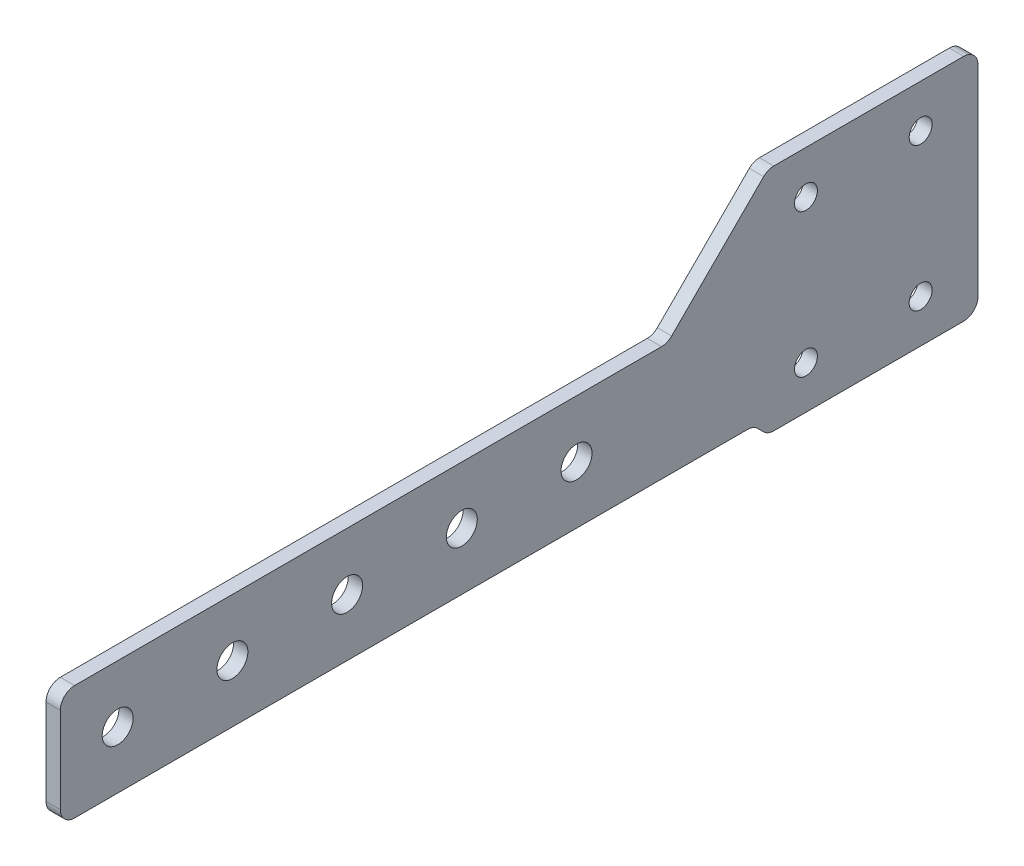
ISO-10303-21;
HEADER;
FILE_DESCRIPTION(('STEP AP214'),'2;1');
FILE_NAME('part.step','',(''),(''),'','','');
FILE_SCHEMA(('AUTOMOTIVE_DESIGN { 1 0 10303 214 1 1 1 1 }'));
ENDSEC;
DATA;
#1=APPLICATION_CONTEXT('core data for automotive mechanical design processes');
#2=APPLICATION_PROTOCOL_DEFINITION('international standard','automotive_design',2000,#1);
#3=PRODUCT_CONTEXT('',#1,'mechanical');
#4=PRODUCT('Part','Part','',(#3));
#5=PRODUCT_RELATED_PRODUCT_CATEGORY('part','',(#4));
#6=PRODUCT_DEFINITION_FORMATION('','',#4);
#7=PRODUCT_DEFINITION_CONTEXT('part definition',#1,'design');
#8=PRODUCT_DEFINITION('design','',#6,#7);
#9=PRODUCT_DEFINITION_SHAPE('','',#8);
#10=(LENGTH_UNIT() NAMED_UNIT(*) SI_UNIT(.MILLI.,.METRE.));
#11=(NAMED_UNIT(*) PLANE_ANGLE_UNIT() SI_UNIT($,.RADIAN.));
#12=(NAMED_UNIT(*) SI_UNIT($,.STERADIAN.) SOLID_ANGLE_UNIT());
#13=UNCERTAINTY_MEASURE_WITH_UNIT(LENGTH_MEASURE(1.E-05),#10,'distance_accuracy_value','');
#14=(GEOMETRIC_REPRESENTATION_CONTEXT(3) GLOBAL_UNCERTAINTY_ASSIGNED_CONTEXT((#13)) GLOBAL_UNIT_ASSIGNED_CONTEXT((#10,
#11,#12)) REPRESENTATION_CONTEXT('',''));
#15=CARTESIAN_POINT('',(0.,0.,0.));
#16=DIRECTION('',(0.,0.,1.));
#17=DIRECTION('',(1.,0.,0.));
#18=AXIS2_PLACEMENT_3D('',#15,#16,#17);
#19=CARTESIAN_POINT('',(3.175,-12.7,-85.725));
#20=DIRECTION('',(-1.,0.,0.));
#21=DIRECTION('',(0.,0.,1.));
#22=AXIS2_PLACEMENT_3D('',#19,#20,#21);
#23=PLANE('',#22);
#24=CARTESIAN_POINT('',(3.175,-12.7,-85.725));
#25=DIRECTION('',(1.,0.,0.));
#26=DIRECTION('',(0.,0.,1.));
#27=AXIS2_PLACEMENT_3D('',#24,#25,#26);
#28=CIRCLE('',#27,3.17500000000001);
#29=CARTESIAN_POINT('',(3.175,-15.875,-85.725));
#30=VERTEX_POINT('',#29);
#31=CARTESIAN_POINT('',(3.175,-12.7,-88.9));
#32=VERTEX_POINT('',#31);
#33=EDGE_CURVE('E240',#30,#32,#28,.T.);
#34=ORIENTED_EDGE('',*,*,#33,.T.);
#35=DIRECTION('',(0.,1.,0.));
#36=VECTOR('',#35,1.);
#37=CARTESIAN_POINT('',(3.175,31.75,-88.9));
#38=LINE('',#37,#36);
#39=CARTESIAN_POINT('',(3.175,31.75,-88.9));
#40=VERTEX_POINT('',#39);
#41=EDGE_CURVE('E128',#32,#40,#38,.T.);
#42=ORIENTED_EDGE('',*,*,#41,.T.);
#43=CARTESIAN_POINT('',(3.175,31.75,-85.725));
#44=DIRECTION('',(1.,0.,0.));
#45=DIRECTION('',(0.,0.,1.));
#46=AXIS2_PLACEMENT_3D('',#43,#44,#45);
#47=CIRCLE('',#46,3.175);
#48=CARTESIAN_POINT('',(3.175,34.925,-85.725));
#49=VERTEX_POINT('',#48);
#50=EDGE_CURVE('E293',#40,#49,#47,.T.);
#51=ORIENTED_EDGE('',*,*,#50,.T.);
#52=DIRECTION('',(0.,0.,1.));
#53=VECTOR('',#52,1.);
#54=CARTESIAN_POINT('',(3.175,34.925,-43.6796158183963));
#55=LINE('',#54,#53);
#56=CARTESIAN_POINT('',(3.175,34.925,-43.6796158183963));
#57=VERTEX_POINT('',#56);
#58=EDGE_CURVE('E313',#49,#57,#55,.T.);
#59=ORIENTED_EDGE('',*,*,#58,.T.);
#60=CARTESIAN_POINT('',(3.175,31.75,-43.6796158183963));
#61=DIRECTION('',(1.,0.,0.));
#62=DIRECTION('',(0.,0.,1.));
#63=AXIS2_PLACEMENT_3D('',#60,#61,#62);
#64=CIRCLE('',#63,3.17499999999999);
#65=CARTESIAN_POINT('',(3.175,33.9950640302673,-41.434551788129));
#66=VERTEX_POINT('',#65);
#67=EDGE_CURVE('E309',#57,#66,#64,.T.);
#68=ORIENTED_EDGE('',*,*,#67,.T.);
#69=DIRECTION('',(0.,-0.707106781186546,0.707106781186549));
#70=VECTOR('',#69,1.);
#71=CARTESIAN_POINT('',(3.175,13.6299359697327,-21.0694237275943));
#72=LINE('',#71,#70);
#73=CARTESIAN_POINT('',(3.175,13.6299359697327,-21.0694237275943));
#74=VERTEX_POINT('',#73);
#75=EDGE_CURVE('E312',#66,#74,#72,.T.);
#76=ORIENTED_EDGE('',*,*,#75,.T.);
#77=CARTESIAN_POINT('',(3.175,15.875,-18.8243596973271));
#78=DIRECTION('',(-1.,0.,0.));
#79=DIRECTION('',(0.,0.,-1.));
#80=AXIS2_PLACEMENT_3D('',#77,#78,#79);
#81=CIRCLE('',#80,3.175);
#82=CARTESIAN_POINT('',(3.175,12.7,-18.8243596973271));
#83=VERTEX_POINT('',#82);
#84=EDGE_CURVE('E317',#74,#83,#81,.T.);
#85=ORIENTED_EDGE('',*,*,#84,.T.);
#86=DIRECTION('',(0.,0.,1.));
#87=VECTOR('',#86,1.);
#88=CARTESIAN_POINT('',(3.175,12.7,111.125));
#89=LINE('',#88,#87);
#90=CARTESIAN_POINT('',(3.175,12.7,111.125));
#91=VERTEX_POINT('',#90);
#92=EDGE_CURVE('E324',#83,#91,#89,.T.);
#93=ORIENTED_EDGE('',*,*,#92,.T.);
#94=CARTESIAN_POINT('',(3.175,9.525,111.125));
#95=DIRECTION('',(1.,0.,0.));
#96=DIRECTION('',(0.,0.,-1.));
#97=AXIS2_PLACEMENT_3D('',#94,#95,#96);
#98=CIRCLE('',#97,3.175);
#99=CARTESIAN_POINT('',(3.175,9.52499999999998,114.3));
#100=VERTEX_POINT('',#99);
#101=EDGE_CURVE('E327',#91,#100,#98,.T.);
#102=ORIENTED_EDGE('',*,*,#101,.T.);
#103=DIRECTION('',(0.,-1.,0.));
#104=VECTOR('',#103,1.);
#105=CARTESIAN_POINT('',(3.175,-9.52499999999999,114.3));
#106=LINE('',#105,#104);
#107=CARTESIAN_POINT('',(3.175,-9.52499999999999,114.3));
#108=VERTEX_POINT('',#107);
#109=EDGE_CURVE('E330',#100,#108,#106,.T.);
#110=ORIENTED_EDGE('',*,*,#109,.T.);
#111=CARTESIAN_POINT('',(3.175,-9.52500000000001,111.125));
#112=DIRECTION('',(1.,0.,0.));
#113=DIRECTION('',(0.,0.,1.));
#114=AXIS2_PLACEMENT_3D('',#111,#112,#113);
#115=CIRCLE('',#114,3.175);
#116=CARTESIAN_POINT('',(3.175,-12.7,111.125));
#117=VERTEX_POINT('',#116);
#118=EDGE_CURVE('E333',#108,#117,#115,.T.);
#119=ORIENTED_EDGE('',*,*,#118,.T.);
#120=DIRECTION('',(0.,0.,-1.));
#121=VECTOR('',#120,1.);
#122=CARTESIAN_POINT('',(3.175,-12.7,-37.8743596973271));
#123=LINE('',#122,#121);
#124=CARTESIAN_POINT('',(3.175,-12.7,-37.8743596973271));
#125=VERTEX_POINT('',#124);
#126=EDGE_CURVE('E336',#117,#125,#123,.T.);
#127=ORIENTED_EDGE('',*,*,#126,.T.);
#128=CARTESIAN_POINT('',(3.175,-15.875,-37.8743596973271));
#129=DIRECTION('',(-1.,0.,0.));
#130=DIRECTION('',(0.,0.,-1.));
#131=AXIS2_PLACEMENT_3D('',#128,#129,#130);
#132=CIRCLE('',#131,3.175);
#133=CARTESIAN_POINT('',(3.175,-13.6299359697327,-40.1194237275944));
#134=VERTEX_POINT('',#133);
#135=EDGE_CURVE('E171',#125,#134,#132,.T.);
#136=ORIENTED_EDGE('',*,*,#135,.T.);
#137=DIRECTION('',(0.,-0.70710678118655,-0.707106781186545));
#138=VECTOR('',#137,1.);
#139=CARTESIAN_POINT('',(3.175,-14.9450640302673,-41.434551788129));
#140=LINE('',#139,#138);
#141=CARTESIAN_POINT('',(3.175,-14.9450640302673,-41.434551788129));
#142=VERTEX_POINT('',#141);
#143=EDGE_CURVE('E165',#134,#142,#140,.T.);
#144=ORIENTED_EDGE('',*,*,#143,.T.);
#145=CARTESIAN_POINT('',(3.175,-12.7,-43.6796158183963));
#146=DIRECTION('',(1.,0.,0.));
#147=DIRECTION('',(0.,0.,1.));
#148=AXIS2_PLACEMENT_3D('',#145,#146,#147);
#149=CIRCLE('',#148,3.175);
#150=CARTESIAN_POINT('',(3.175,-15.875,-43.6796158183963));
#151=VERTEX_POINT('',#150);
#152=EDGE_CURVE('E169',#142,#151,#149,.T.);
#153=ORIENTED_EDGE('',*,*,#152,.T.);
#154=DIRECTION('',(0.,0.,-1.));
#155=VECTOR('',#154,1.);
#156=CARTESIAN_POINT('',(3.175,-15.875,-85.725));
#157=LINE('',#156,#155);
#158=EDGE_CURVE('E61',#151,#30,#157,.T.);
#159=ORIENTED_EDGE('',*,*,#158,.T.);
#160=EDGE_LOOP('',(#34,#42,#51,#59,#68,#76,#85,#93,#102,#110,#119,#127,#136,#144,#153,#159));
#161=FACE_BOUND('',#160,.T.);
#162=CARTESIAN_POINT('',(3.175,0.,101.6));
#163=DIRECTION('',(1.,0.,0.));
#164=DIRECTION('',(0.,0.,-1.));
#165=AXIS2_PLACEMENT_3D('',#162,#163,#164);
#166=CIRCLE('',#165,3.429);
#167=CARTESIAN_POINT('',(3.175,0.,98.171));
#168=VERTEX_POINT('',#167);
#169=EDGE_CURVE('E198',#168,#168,#166,.T.);
#170=ORIENTED_EDGE('',*,*,#169,.F.);
#171=EDGE_LOOP('',(#170));
#172=FACE_BOUND('',#171,.T.);
#173=CARTESIAN_POINT('',(3.175,0.,76.2));
#174=DIRECTION('',(1.,0.,0.));
#175=DIRECTION('',(0.,0.,-1.));
#176=AXIS2_PLACEMENT_3D('',#173,#174,#175);
#177=CIRCLE('',#176,3.429);
#178=CARTESIAN_POINT('',(3.175,0.,72.771));
#179=VERTEX_POINT('',#178);
#180=EDGE_CURVE('E466',#179,#179,#177,.T.);
#181=ORIENTED_EDGE('',*,*,#180,.F.);
#182=EDGE_LOOP('',(#181));
#183=FACE_BOUND('',#182,.T.);
#184=CARTESIAN_POINT('',(3.175,0.,50.8));
#185=DIRECTION('',(1.,0.,0.));
#186=DIRECTION('',(0.,0.,-1.));
#187=AXIS2_PLACEMENT_3D('',#184,#185,#186);
#188=CIRCLE('',#187,3.429);
#189=CARTESIAN_POINT('',(3.175,0.,47.371));
#190=VERTEX_POINT('',#189);
#191=EDGE_CURVE('E458',#190,#190,#188,.T.);
#192=ORIENTED_EDGE('',*,*,#191,.F.);
#193=EDGE_LOOP('',(#192));
#194=FACE_BOUND('',#193,.T.);
#195=CARTESIAN_POINT('',(3.175,0.,25.4));
#196=DIRECTION('',(1.,0.,0.));
#197=DIRECTION('',(0.,0.,-1.));
#198=AXIS2_PLACEMENT_3D('',#195,#196,#197);
#199=CIRCLE('',#198,3.429);
#200=CARTESIAN_POINT('',(3.175,0.,21.971));
#201=VERTEX_POINT('',#200);
#202=EDGE_CURVE('E450',#201,#201,#199,.T.);
#203=ORIENTED_EDGE('',*,*,#202,.F.);
#204=EDGE_LOOP('',(#203));
#205=FACE_BOUND('',#204,.T.);
#206=CARTESIAN_POINT('',(3.175,0.,0.));
#207=DIRECTION('',(1.,0.,0.));
#208=DIRECTION('',(0.,0.,-1.));
#209=AXIS2_PLACEMENT_3D('',#206,#207,#208);
#210=CIRCLE('',#209,3.429);
#211=CARTESIAN_POINT('',(3.175,0.,-3.429));
#212=VERTEX_POINT('',#211);
#213=EDGE_CURVE('E442',#212,#212,#210,.T.);
#214=ORIENTED_EDGE('',*,*,#213,.F.);
#215=EDGE_LOOP('',(#214));
#216=FACE_BOUND('',#215,.T.);
#217=CARTESIAN_POINT('',(3.175,25.4,-50.8));
#218=DIRECTION('',(1.,0.,0.));
#219=DIRECTION('',(0.,0.,-1.));
#220=AXIS2_PLACEMENT_3D('',#217,#218,#219);
#221=CIRCLE('',#220,2.54);
#222=CARTESIAN_POINT('',(3.175,25.4,-53.34));
#223=VERTEX_POINT('',#222);
#224=EDGE_CURVE('E434',#223,#223,#221,.T.);
#225=ORIENTED_EDGE('',*,*,#224,.F.);
#226=EDGE_LOOP('',(#225));
#227=FACE_BOUND('',#226,.T.);
#228=CARTESIAN_POINT('',(3.175,25.4,-76.2));
#229=DIRECTION('',(1.,0.,0.));
#230=DIRECTION('',(0.,0.,-1.));
#231=AXIS2_PLACEMENT_3D('',#228,#229,#230);
#232=CIRCLE('',#231,2.54);
#233=CARTESIAN_POINT('',(3.175,25.4,-78.74));
#234=VERTEX_POINT('',#233);
#235=EDGE_CURVE('E426',#234,#234,#232,.T.);
#236=ORIENTED_EDGE('',*,*,#235,.F.);
#237=EDGE_LOOP('',(#236));
#238=FACE_BOUND('',#237,.T.);
#239=CARTESIAN_POINT('',(3.175,-6.35,-50.8));
#240=DIRECTION('',(1.,0.,0.));
#241=DIRECTION('',(0.,0.,-1.));
#242=AXIS2_PLACEMENT_3D('',#239,#240,#241);
#243=CIRCLE('',#242,2.54);
#244=CARTESIAN_POINT('',(3.175,-6.35,-53.34));
#245=VERTEX_POINT('',#244);
#246=EDGE_CURVE('E418',#245,#245,#243,.T.);
#247=ORIENTED_EDGE('',*,*,#246,.F.);
#248=EDGE_LOOP('',(#247));
#249=FACE_BOUND('',#248,.T.);
#250=CARTESIAN_POINT('',(3.175,-6.35,-76.2));
#251=DIRECTION('',(1.,0.,0.));
#252=DIRECTION('',(0.,0.,-1.));
#253=AXIS2_PLACEMENT_3D('',#250,#251,#252);
#254=CIRCLE('',#253,2.54);
#255=CARTESIAN_POINT('',(3.175,-6.35,-78.74));
#256=VERTEX_POINT('',#255);
#257=EDGE_CURVE('E407',#256,#256,#254,.T.);
#258=ORIENTED_EDGE('',*,*,#257,.F.);
#259=EDGE_LOOP('',(#258));
#260=FACE_BOUND('',#259,.T.);
#261=ADVANCED_FACE('F43',(#161,#172,#183,#194,#205,#216,#227,#238,#249,#260),#23,.F.);
#262=CARTESIAN_POINT('',(0.,-12.7,-85.725));
#263=DIRECTION('',(-1.,0.,0.));
#264=DIRECTION('',(0.,0.,1.));
#265=AXIS2_PLACEMENT_3D('',#262,#263,#264);
#266=PLANE('',#265);
#267=CARTESIAN_POINT('',(0.,-6.35,-50.8));
#268=DIRECTION('',(1.,0.,0.));
#269=DIRECTION('',(0.,0.,-1.));
#270=AXIS2_PLACEMENT_3D('',#267,#268,#269);
#271=CIRCLE('',#270,2.54);
#272=CARTESIAN_POINT('',(0.,-6.35,-53.34));
#273=VERTEX_POINT('',#272);
#274=EDGE_CURVE('E415',#273,#273,#271,.T.);
#275=ORIENTED_EDGE('',*,*,#274,.T.);
#276=EDGE_LOOP('',(#275));
#277=FACE_BOUND('',#276,.T.);
#278=CARTESIAN_POINT('',(0.,25.4,-50.8));
#279=DIRECTION('',(1.,0.,0.));
#280=DIRECTION('',(0.,0.,-1.));
#281=AXIS2_PLACEMENT_3D('',#278,#279,#280);
#282=CIRCLE('',#281,2.54);
#283=CARTESIAN_POINT('',(0.,25.4,-53.34));
#284=VERTEX_POINT('',#283);
#285=EDGE_CURVE('E430',#284,#284,#282,.T.);
#286=ORIENTED_EDGE('',*,*,#285,.T.);
#287=EDGE_LOOP('',(#286));
#288=FACE_BOUND('',#287,.T.);
#289=CARTESIAN_POINT('',(0.,0.,25.4));
#290=DIRECTION('',(1.,0.,0.));
#291=DIRECTION('',(0.,0.,-1.));
#292=AXIS2_PLACEMENT_3D('',#289,#290,#291);
#293=CIRCLE('',#292,3.429);
#294=CARTESIAN_POINT('',(0.,0.,21.971));
#295=VERTEX_POINT('',#294);
#296=EDGE_CURVE('E446',#295,#295,#293,.T.);
#297=ORIENTED_EDGE('',*,*,#296,.T.);
#298=EDGE_LOOP('',(#297));
#299=FACE_BOUND('',#298,.T.);
#300=CARTESIAN_POINT('',(0.,0.,76.2));
#301=DIRECTION('',(1.,0.,0.));
#302=DIRECTION('',(0.,0.,-1.));
#303=AXIS2_PLACEMENT_3D('',#300,#301,#302);
#304=CIRCLE('',#303,3.429);
#305=CARTESIAN_POINT('',(0.,0.,72.771));
#306=VERTEX_POINT('',#305);
#307=EDGE_CURVE('E462',#306,#306,#304,.T.);
#308=ORIENTED_EDGE('',*,*,#307,.T.);
#309=EDGE_LOOP('',(#308));
#310=FACE_BOUND('',#309,.T.);
#311=CARTESIAN_POINT('',(0.,-12.7,-85.725));
#312=DIRECTION('',(1.,0.,0.));
#313=DIRECTION('',(0.,0.,1.));
#314=AXIS2_PLACEMENT_3D('',#311,#312,#313);
#315=CIRCLE('',#314,3.17500000000001);
#316=CARTESIAN_POINT('',(0.,-15.875,-85.725));
#317=VERTEX_POINT('',#316);
#318=CARTESIAN_POINT('',(0.,-12.7,-88.9));
#319=VERTEX_POINT('',#318);
#320=EDGE_CURVE('E193',#317,#319,#315,.T.);
#321=ORIENTED_EDGE('',*,*,#320,.F.);
#322=DIRECTION('',(0.,0.,-1.));
#323=VECTOR('',#322,1.);
#324=CARTESIAN_POINT('',(0.,-15.875,-85.725));
#325=LINE('',#324,#323);
#326=CARTESIAN_POINT('',(0.,-15.875,-43.6796158183963));
#327=VERTEX_POINT('',#326);
#328=EDGE_CURVE('E120',#327,#317,#325,.T.);
#329=ORIENTED_EDGE('',*,*,#328,.F.);
#330=CARTESIAN_POINT('',(0.,-12.7,-43.6796158183963));
#331=DIRECTION('',(1.,0.,0.));
#332=DIRECTION('',(0.,0.,1.));
#333=AXIS2_PLACEMENT_3D('',#330,#331,#332);
#334=CIRCLE('',#333,3.175);
#335=CARTESIAN_POINT('',(0.,-14.9450640302673,-41.434551788129));
#336=VERTEX_POINT('',#335);
#337=EDGE_CURVE('E114',#336,#327,#334,.T.);
#338=ORIENTED_EDGE('',*,*,#337,.F.);
#339=DIRECTION('',(0.,-0.70710678118655,-0.707106781186545));
#340=VECTOR('',#339,1.);
#341=CARTESIAN_POINT('',(0.,-14.9450640302673,-41.434551788129));
#342=LINE('',#341,#340);
#343=CARTESIAN_POINT('',(0.,-13.6299359697327,-40.1194237275944));
#344=VERTEX_POINT('',#343);
#345=EDGE_CURVE('E180',#344,#336,#342,.T.);
#346=ORIENTED_EDGE('',*,*,#345,.F.);
#347=CARTESIAN_POINT('',(0.,-15.875,-37.8743596973271));
#348=DIRECTION('',(-1.,0.,0.));
#349=DIRECTION('',(0.,0.,-1.));
#350=AXIS2_PLACEMENT_3D('',#347,#348,#349);
#351=CIRCLE('',#350,3.175);
#352=CARTESIAN_POINT('',(0.,-12.7,-37.8743596973271));
#353=VERTEX_POINT('',#352);
#354=EDGE_CURVE('E231',#353,#344,#351,.T.);
#355=ORIENTED_EDGE('',*,*,#354,.F.);
#356=DIRECTION('',(0.,0.,-1.));
#357=VECTOR('',#356,1.);
#358=CARTESIAN_POINT('',(0.,-12.7,-37.8743596973271));
#359=LINE('',#358,#357);
#360=CARTESIAN_POINT('',(0.,-12.7,111.125));
#361=VERTEX_POINT('',#360);
#362=EDGE_CURVE('E228',#361,#353,#359,.T.);
#363=ORIENTED_EDGE('',*,*,#362,.F.);
#364=CARTESIAN_POINT('',(0.,-9.52500000000001,111.125));
#365=DIRECTION('',(1.,0.,0.));
#366=DIRECTION('',(0.,0.,1.));
#367=AXIS2_PLACEMENT_3D('',#364,#365,#366);
#368=CIRCLE('',#367,3.175);
#369=CARTESIAN_POINT('',(0.,-9.52499999999999,114.3));
#370=VERTEX_POINT('',#369);
#371=EDGE_CURVE('E225',#370,#361,#368,.T.);
#372=ORIENTED_EDGE('',*,*,#371,.F.);
#373=DIRECTION('',(0.,-1.,0.));
#374=VECTOR('',#373,1.);
#375=CARTESIAN_POINT('',(0.,-9.52499999999999,114.3));
#376=LINE('',#375,#374);
#377=CARTESIAN_POINT('',(0.,9.52499999999998,114.3));
#378=VERTEX_POINT('',#377);
#379=EDGE_CURVE('E222',#378,#370,#376,.T.);
#380=ORIENTED_EDGE('',*,*,#379,.F.);
#381=CARTESIAN_POINT('',(0.,9.525,111.125));
#382=DIRECTION('',(1.,0.,0.));
#383=DIRECTION('',(0.,0.,-1.));
#384=AXIS2_PLACEMENT_3D('',#381,#382,#383);
#385=CIRCLE('',#384,3.175);
#386=CARTESIAN_POINT('',(0.,12.7,111.125));
#387=VERTEX_POINT('',#386);
#388=EDGE_CURVE('E219',#387,#378,#385,.T.);
#389=ORIENTED_EDGE('',*,*,#388,.F.);
#390=DIRECTION('',(0.,0.,1.));
#391=VECTOR('',#390,1.);
#392=CARTESIAN_POINT('',(0.,12.7,111.125));
#393=LINE('',#392,#391);
#394=CARTESIAN_POINT('',(0.,12.7,-18.8243596973271));
#395=VERTEX_POINT('',#394);
#396=EDGE_CURVE('E216',#395,#387,#393,.T.);
#397=ORIENTED_EDGE('',*,*,#396,.F.);
#398=CARTESIAN_POINT('',(0.,15.875,-18.8243596973271));
#399=DIRECTION('',(-1.,0.,0.));
#400=DIRECTION('',(0.,0.,-1.));
#401=AXIS2_PLACEMENT_3D('',#398,#399,#400);
#402=CIRCLE('',#401,3.175);
#403=CARTESIAN_POINT('',(0.,13.6299359697327,-21.0694237275943));
#404=VERTEX_POINT('',#403);
#405=EDGE_CURVE('E213',#404,#395,#402,.T.);
#406=ORIENTED_EDGE('',*,*,#405,.F.);
#407=DIRECTION('',(0.,-0.707106781186546,0.707106781186549));
#408=VECTOR('',#407,1.);
#409=CARTESIAN_POINT('',(0.,13.6299359697327,-21.0694237275943));
#410=LINE('',#409,#408);
#411=CARTESIAN_POINT('',(0.,33.9950640302673,-41.434551788129));
#412=VERTEX_POINT('',#411);
#413=EDGE_CURVE('E210',#412,#404,#410,.T.);
#414=ORIENTED_EDGE('',*,*,#413,.F.);
#415=CARTESIAN_POINT('',(0.,31.75,-43.6796158183963));
#416=DIRECTION('',(1.,0.,0.));
#417=DIRECTION('',(0.,0.,1.));
#418=AXIS2_PLACEMENT_3D('',#415,#416,#417);
#419=CIRCLE('',#418,3.17499999999999);
#420=CARTESIAN_POINT('',(0.,34.925,-43.6796158183963));
#421=VERTEX_POINT('',#420);
#422=EDGE_CURVE('E207',#421,#412,#419,.T.);
#423=ORIENTED_EDGE('',*,*,#422,.F.);
#424=DIRECTION('',(0.,0.,1.));
#425=VECTOR('',#424,1.);
#426=CARTESIAN_POINT('',(0.,34.925,-43.6796158183963));
#427=LINE('',#426,#425);
#428=CARTESIAN_POINT('',(0.,34.925,-85.725));
#429=VERTEX_POINT('',#428);
#430=EDGE_CURVE('E204',#429,#421,#427,.T.);
#431=ORIENTED_EDGE('',*,*,#430,.F.);
#432=CARTESIAN_POINT('',(0.,31.75,-85.725));
#433=DIRECTION('',(1.,0.,0.));
#434=DIRECTION('',(0.,0.,1.));
#435=AXIS2_PLACEMENT_3D('',#432,#433,#434);
#436=CIRCLE('',#435,3.175);
#437=CARTESIAN_POINT('',(0.,31.75,-88.9));
#438=VERTEX_POINT('',#437);
#439=EDGE_CURVE('E201',#438,#429,#436,.T.);
#440=ORIENTED_EDGE('',*,*,#439,.F.);
#441=DIRECTION('',(0.,1.,0.));
#442=VECTOR('',#441,1.);
#443=CARTESIAN_POINT('',(0.,31.75,-88.9));
#444=LINE('',#443,#442);
#445=EDGE_CURVE('E197',#319,#438,#444,.T.);
#446=ORIENTED_EDGE('',*,*,#445,.F.);
#447=EDGE_LOOP('',(#321,#329,#338,#346,#355,#363,#372,#380,#389,#397,#406,#414,#423,#431,#440,#446));
#448=FACE_BOUND('',#447,.T.);
#449=CARTESIAN_POINT('',(0.,0.,101.6));
#450=DIRECTION('',(1.,0.,0.));
#451=DIRECTION('',(0.,0.,-1.));
#452=AXIS2_PLACEMENT_3D('',#449,#450,#451);
#453=CIRCLE('',#452,3.429);
#454=CARTESIAN_POINT('',(0.,0.,98.171));
#455=VERTEX_POINT('',#454);
#456=EDGE_CURVE('E470',#455,#455,#453,.T.);
#457=ORIENTED_EDGE('',*,*,#456,.T.);
#458=EDGE_LOOP('',(#457));
#459=FACE_BOUND('',#458,.T.);
#460=CARTESIAN_POINT('',(0.,0.,50.8));
#461=DIRECTION('',(1.,0.,0.));
#462=DIRECTION('',(0.,0.,-1.));
#463=AXIS2_PLACEMENT_3D('',#460,#461,#462);
#464=CIRCLE('',#463,3.429);
#465=CARTESIAN_POINT('',(0.,0.,47.371));
#466=VERTEX_POINT('',#465);
#467=EDGE_CURVE('E454',#466,#466,#464,.T.);
#468=ORIENTED_EDGE('',*,*,#467,.T.);
#469=EDGE_LOOP('',(#468));
#470=FACE_BOUND('',#469,.T.);
#471=CARTESIAN_POINT('',(0.,0.,0.));
#472=DIRECTION('',(1.,0.,0.));
#473=DIRECTION('',(0.,0.,-1.));
#474=AXIS2_PLACEMENT_3D('',#471,#472,#473);
#475=CIRCLE('',#474,3.429);
#476=CARTESIAN_POINT('',(0.,0.,-3.429));
#477=VERTEX_POINT('',#476);
#478=EDGE_CURVE('E438',#477,#477,#475,.T.);
#479=ORIENTED_EDGE('',*,*,#478,.T.);
#480=EDGE_LOOP('',(#479));
#481=FACE_BOUND('',#480,.T.);
#482=CARTESIAN_POINT('',(0.,25.4,-76.2));
#483=DIRECTION('',(1.,0.,0.));
#484=DIRECTION('',(0.,0.,-1.));
#485=AXIS2_PLACEMENT_3D('',#482,#483,#484);
#486=CIRCLE('',#485,2.54);
#487=CARTESIAN_POINT('',(0.,25.4,-78.74));
#488=VERTEX_POINT('',#487);
#489=EDGE_CURVE('E422',#488,#488,#486,.T.);
#490=ORIENTED_EDGE('',*,*,#489,.T.);
#491=EDGE_LOOP('',(#490));
#492=FACE_BOUND('',#491,.T.);
#493=CARTESIAN_POINT('',(0.,-6.35,-76.2));
#494=DIRECTION('',(1.,0.,0.));
#495=DIRECTION('',(0.,0.,-1.));
#496=AXIS2_PLACEMENT_3D('',#493,#494,#495);
#497=CIRCLE('',#496,2.54);
#498=CARTESIAN_POINT('',(0.,-6.35,-78.74));
#499=VERTEX_POINT('',#498);
#500=EDGE_CURVE('E410',#499,#499,#497,.T.);
#501=ORIENTED_EDGE('',*,*,#500,.T.);
#502=EDGE_LOOP('',(#501));
#503=FACE_BOUND('',#502,.T.);
#504=ADVANCED_FACE('F297',(#277,#288,#299,#310,#448,#459,#470,#481,#492,#503),#266,.T.);
#505=CARTESIAN_POINT('',(3.175,-12.7,-85.725));
#506=DIRECTION('',(-1.,0.,0.));
#507=DIRECTION('',(0.,0.,1.));
#508=AXIS2_PLACEMENT_3D('',#505,#506,#507);
#509=CYLINDRICAL_SURFACE('',#508,3.17500000000001);
#510=ORIENTED_EDGE('',*,*,#320,.T.);
#511=DIRECTION('',(-1.,0.,0.));
#512=VECTOR('',#511,1.);
#513=CARTESIAN_POINT('',(3.175,-12.7,-88.9));
#514=LINE('',#513,#512);
#515=EDGE_CURVE('E11',#32,#319,#514,.T.);
#516=ORIENTED_EDGE('',*,*,#515,.F.);
#517=ORIENTED_EDGE('',*,*,#33,.F.);
#518=DIRECTION('',(-1.,0.,0.));
#519=VECTOR('',#518,1.);
#520=CARTESIAN_POINT('',(3.175,-15.875,-85.725));
#521=LINE('',#520,#519);
#522=EDGE_CURVE('E189',#30,#317,#521,.T.);
#523=ORIENTED_EDGE('',*,*,#522,.T.);
#524=EDGE_LOOP('',(#510,#516,#517,#523));
#525=FACE_BOUND('',#524,.T.);
#526=ADVANCED_FACE('F45',(#525),#509,.T.);
#527=CARTESIAN_POINT('',(3.175,31.75,-88.9));
#528=DIRECTION('',(0.,0.,1.));
#529=DIRECTION('',(0.,-1.,0.));
#530=AXIS2_PLACEMENT_3D('',#527,#528,#529);
#531=PLANE('',#530);
#532=ORIENTED_EDGE('',*,*,#445,.T.);
#533=DIRECTION('',(-1.,0.,0.));
#534=VECTOR('',#533,1.);
#535=CARTESIAN_POINT('',(3.175,31.75,-88.9));
#536=LINE('',#535,#534);
#537=EDGE_CURVE('E53',#40,#438,#536,.T.);
#538=ORIENTED_EDGE('',*,*,#537,.F.);
#539=ORIENTED_EDGE('',*,*,#41,.F.);
#540=ORIENTED_EDGE('',*,*,#515,.T.);
#541=EDGE_LOOP('',(#532,#538,#539,#540));
#542=FACE_BOUND('',#541,.T.);
#543=ADVANCED_FACE('F687',(#542),#531,.F.);
#544=CARTESIAN_POINT('',(3.175,31.75,-85.725));
#545=DIRECTION('',(-1.,0.,0.));
#546=DIRECTION('',(0.,0.,1.));
#547=AXIS2_PLACEMENT_3D('',#544,#545,#546);
#548=CYLINDRICAL_SURFACE('',#547,3.175);
#549=ORIENTED_EDGE('',*,*,#439,.T.);
#550=DIRECTION('',(-1.,0.,0.));
#551=VECTOR('',#550,1.);
#552=CARTESIAN_POINT('',(3.175,34.925,-85.725));
#553=LINE('',#552,#551);
#554=EDGE_CURVE('E283',#49,#429,#553,.T.);
#555=ORIENTED_EDGE('',*,*,#554,.F.);
#556=ORIENTED_EDGE('',*,*,#50,.F.);
#557=ORIENTED_EDGE('',*,*,#537,.T.);
#558=EDGE_LOOP('',(#549,#555,#556,#557));
#559=FACE_BOUND('',#558,.T.);
#560=ADVANCED_FACE('F291',(#559),#548,.T.);
#561=CARTESIAN_POINT('',(3.175,34.925,-43.6796158183963));
#562=DIRECTION('',(0.,-1.,0.));
#563=DIRECTION('',(0.,0.,-1.));
#564=AXIS2_PLACEMENT_3D('',#561,#562,#563);
#565=PLANE('',#564);
#566=ORIENTED_EDGE('',*,*,#430,.T.);
#567=DIRECTION('',(-1.,0.,0.));
#568=VECTOR('',#567,1.);
#569=CARTESIAN_POINT('',(3.175,34.925,-43.6796158183963));
#570=LINE('',#569,#568);
#571=EDGE_CURVE('E279',#57,#421,#570,.T.);
#572=ORIENTED_EDGE('',*,*,#571,.F.);
#573=ORIENTED_EDGE('',*,*,#58,.F.);
#574=ORIENTED_EDGE('',*,*,#554,.T.);
#575=EDGE_LOOP('',(#566,#572,#573,#574));
#576=FACE_BOUND('',#575,.T.);
#577=ADVANCED_FACE('F303',(#576),#565,.F.);
#578=CARTESIAN_POINT('',(3.175,31.75,-43.6796158183963));
#579=DIRECTION('',(-1.,0.,0.));
#580=DIRECTION('',(0.,0.,1.));
#581=AXIS2_PLACEMENT_3D('',#578,#579,#580);
#582=CYLINDRICAL_SURFACE('',#581,3.17499999999999);
#583=ORIENTED_EDGE('',*,*,#422,.T.);
#584=DIRECTION('',(-1.,0.,0.));
#585=VECTOR('',#584,1.);
#586=CARTESIAN_POINT('',(3.175,33.9950640302673,-41.434551788129));
#587=LINE('',#586,#585);
#588=EDGE_CURVE('E275',#66,#412,#587,.T.);
#589=ORIENTED_EDGE('',*,*,#588,.F.);
#590=ORIENTED_EDGE('',*,*,#67,.F.);
#591=ORIENTED_EDGE('',*,*,#571,.T.);
#592=EDGE_LOOP('',(#583,#589,#590,#591));
#593=FACE_BOUND('',#592,.T.);
#594=ADVANCED_FACE('F307',(#593),#582,.T.);
#595=CARTESIAN_POINT('',(3.175,13.6299359697327,-21.0694237275943));
#596=DIRECTION('',(0.,-0.707106781186549,-0.707106781186546));
#597=DIRECTION('',(0.,0.707106781186546,-0.707106781186549));
#598=AXIS2_PLACEMENT_3D('',#595,#596,#597);
#599=PLANE('',#598);
#600=ORIENTED_EDGE('',*,*,#413,.T.);
#601=DIRECTION('',(-1.,0.,0.));
#602=VECTOR('',#601,1.);
#603=CARTESIAN_POINT('',(3.175,13.6299359697327,-21.0694237275943));
#604=LINE('',#603,#602);
#605=EDGE_CURVE('E271',#74,#404,#604,.T.);
#606=ORIENTED_EDGE('',*,*,#605,.F.);
#607=ORIENTED_EDGE('',*,*,#75,.F.);
#608=ORIENTED_EDGE('',*,*,#588,.T.);
#609=EDGE_LOOP('',(#600,#606,#607,#608));
#610=FACE_BOUND('',#609,.T.);
#611=ADVANCED_FACE('F648',(#610),#599,.F.);
#612=CARTESIAN_POINT('',(3.175,15.875,-18.8243596973271));
#613=DIRECTION('',(-1.,0.,0.));
#614=DIRECTION('',(0.,0.,1.));
#615=AXIS2_PLACEMENT_3D('',#612,#613,#614);
#616=CYLINDRICAL_SURFACE('',#615,3.175);
#617=ORIENTED_EDGE('',*,*,#405,.T.);
#618=DIRECTION('',(-1.,0.,0.));
#619=VECTOR('',#618,1.);
#620=CARTESIAN_POINT('',(3.175,12.7,-18.8243596973271));
#621=LINE('',#620,#619);
#622=EDGE_CURVE('E267',#83,#395,#621,.T.);
#623=ORIENTED_EDGE('',*,*,#622,.F.);
#624=ORIENTED_EDGE('',*,*,#84,.F.);
#625=ORIENTED_EDGE('',*,*,#605,.T.);
#626=EDGE_LOOP('',(#617,#623,#624,#625));
#627=FACE_BOUND('',#626,.T.);
#628=ADVANCED_FACE('F637',(#627),#616,.F.);
#629=CARTESIAN_POINT('',(3.175,12.7,111.125));
#630=DIRECTION('',(0.,-1.,0.));
#631=DIRECTION('',(0.,0.,-1.));
#632=AXIS2_PLACEMENT_3D('',#629,#630,#631);
#633=PLANE('',#632);
#634=ORIENTED_EDGE('',*,*,#396,.T.);
#635=DIRECTION('',(-1.,0.,0.));
#636=VECTOR('',#635,1.);
#637=CARTESIAN_POINT('',(3.175,12.7,111.125));
#638=LINE('',#637,#636);
#639=EDGE_CURVE('E263',#91,#387,#638,.T.);
#640=ORIENTED_EDGE('',*,*,#639,.F.);
#641=ORIENTED_EDGE('',*,*,#92,.F.);
#642=ORIENTED_EDGE('',*,*,#622,.T.);
#643=EDGE_LOOP('',(#634,#640,#641,#642));
#644=FACE_BOUND('',#643,.T.);
#645=ADVANCED_FACE('F626',(#644),#633,.F.);
#646=CARTESIAN_POINT('',(3.175,9.525,111.125));
#647=DIRECTION('',(-1.,0.,0.));
#648=DIRECTION('',(0.,0.,1.));
#649=AXIS2_PLACEMENT_3D('',#646,#647,#648);
#650=CYLINDRICAL_SURFACE('',#649,3.175);
#651=ORIENTED_EDGE('',*,*,#388,.T.);
#652=DIRECTION('',(-1.,0.,0.));
#653=VECTOR('',#652,1.);
#654=CARTESIAN_POINT('',(3.175,9.52499999999998,114.3));
#655=LINE('',#654,#653);
#656=EDGE_CURVE('E259',#100,#378,#655,.T.);
#657=ORIENTED_EDGE('',*,*,#656,.F.);
#658=ORIENTED_EDGE('',*,*,#101,.F.);
#659=ORIENTED_EDGE('',*,*,#639,.T.);
#660=EDGE_LOOP('',(#651,#657,#658,#659));
#661=FACE_BOUND('',#660,.T.);
#662=ADVANCED_FACE('F615',(#661),#650,.T.);
#663=CARTESIAN_POINT('',(3.175,-9.52499999999999,114.3));
#664=DIRECTION('',(0.,0.,-1.));
#665=DIRECTION('',(0.,1.,0.));
#666=AXIS2_PLACEMENT_3D('',#663,#664,#665);
#667=PLANE('',#666);
#668=ORIENTED_EDGE('',*,*,#379,.T.);
#669=DIRECTION('',(-1.,0.,0.));
#670=VECTOR('',#669,1.);
#671=CARTESIAN_POINT('',(3.175,-9.52499999999999,114.3));
#672=LINE('',#671,#670);
#673=EDGE_CURVE('E255',#108,#370,#672,.T.);
#674=ORIENTED_EDGE('',*,*,#673,.F.);
#675=ORIENTED_EDGE('',*,*,#109,.F.);
#676=ORIENTED_EDGE('',*,*,#656,.T.);
#677=EDGE_LOOP('',(#668,#674,#675,#676));
#678=FACE_BOUND('',#677,.T.);
#679=ADVANCED_FACE('F604',(#678),#667,.F.);
#680=CARTESIAN_POINT('',(3.175,-9.52500000000001,111.125));
#681=DIRECTION('',(-1.,0.,0.));
#682=DIRECTION('',(0.,0.,1.));
#683=AXIS2_PLACEMENT_3D('',#680,#681,#682);
#684=CYLINDRICAL_SURFACE('',#683,3.175);
#685=ORIENTED_EDGE('',*,*,#371,.T.);
#686=DIRECTION('',(-1.,0.,0.));
#687=VECTOR('',#686,1.);
#688=CARTESIAN_POINT('',(3.175,-12.7,111.125));
#689=LINE('',#688,#687);
#690=EDGE_CURVE('E251',#117,#361,#689,.T.);
#691=ORIENTED_EDGE('',*,*,#690,.F.);
#692=ORIENTED_EDGE('',*,*,#118,.F.);
#693=ORIENTED_EDGE('',*,*,#673,.T.);
#694=EDGE_LOOP('',(#685,#691,#692,#693));
#695=FACE_BOUND('',#694,.T.);
#696=ADVANCED_FACE('F594',(#695),#684,.T.);
#697=CARTESIAN_POINT('',(3.175,-12.7,-37.8743596973271));
#698=DIRECTION('',(0.,1.,0.));
#699=DIRECTION('',(0.,0.,1.));
#700=AXIS2_PLACEMENT_3D('',#697,#698,#699);
#701=PLANE('',#700);
#702=ORIENTED_EDGE('',*,*,#362,.T.);
#703=DIRECTION('',(-1.,0.,0.));
#704=VECTOR('',#703,1.);
#705=CARTESIAN_POINT('',(3.175,-12.7,-37.8743596973271));
#706=LINE('',#705,#704);
#707=EDGE_CURVE('E247',#125,#353,#706,.T.);
#708=ORIENTED_EDGE('',*,*,#707,.F.);
#709=ORIENTED_EDGE('',*,*,#126,.F.);
#710=ORIENTED_EDGE('',*,*,#690,.T.);
#711=EDGE_LOOP('',(#702,#708,#709,#710));
#712=FACE_BOUND('',#711,.T.);
#713=ADVANCED_FACE('F344',(#712),#701,.F.);
#714=CARTESIAN_POINT('',(3.175,-15.875,-37.8743596973271));
#715=DIRECTION('',(-1.,0.,0.));
#716=DIRECTION('',(0.,0.,1.));
#717=AXIS2_PLACEMENT_3D('',#714,#715,#716);
#718=CYLINDRICAL_SURFACE('',#717,3.175);
#719=ORIENTED_EDGE('',*,*,#354,.T.);
#720=DIRECTION('',(-1.,0.,0.));
#721=VECTOR('',#720,1.);
#722=CARTESIAN_POINT('',(3.175,-13.6299359697327,-40.1194237275944));
#723=LINE('',#722,#721);
#724=EDGE_CURVE('E182',#134,#344,#723,.T.);
#725=ORIENTED_EDGE('',*,*,#724,.F.);
#726=ORIENTED_EDGE('',*,*,#135,.F.);
#727=ORIENTED_EDGE('',*,*,#707,.T.);
#728=EDGE_LOOP('',(#719,#725,#726,#727));
#729=FACE_BOUND('',#728,.T.);
#730=ADVANCED_FACE('F348',(#729),#718,.F.);
#731=CARTESIAN_POINT('',(3.175,-14.9450640302673,-41.434551788129));
#732=DIRECTION('',(0.,0.707106781186545,-0.70710678118655));
#733=DIRECTION('',(0.,0.70710678118655,0.707106781186545));
#734=AXIS2_PLACEMENT_3D('',#731,#732,#733);
#735=PLANE('',#734);
#736=ORIENTED_EDGE('',*,*,#345,.T.);
#737=DIRECTION('',(-1.,0.,0.));
#738=VECTOR('',#737,1.);
#739=CARTESIAN_POINT('',(3.175,-14.9450640302673,-41.434551788129));
#740=LINE('',#739,#738);
#741=EDGE_CURVE('E177',#142,#336,#740,.T.);
#742=ORIENTED_EDGE('',*,*,#741,.F.);
#743=ORIENTED_EDGE('',*,*,#143,.F.);
#744=ORIENTED_EDGE('',*,*,#724,.T.);
#745=EDGE_LOOP('',(#736,#742,#743,#744));
#746=FACE_BOUND('',#745,.T.);
#747=ADVANCED_FACE('F178',(#746),#735,.F.);
#748=CARTESIAN_POINT('',(3.175,-12.7,-43.6796158183963));
#749=DIRECTION('',(-1.,0.,0.));
#750=DIRECTION('',(0.,0.,1.));
#751=AXIS2_PLACEMENT_3D('',#748,#749,#750);
#752=CYLINDRICAL_SURFACE('',#751,3.175);
#753=ORIENTED_EDGE('',*,*,#337,.T.);
#754=DIRECTION('',(-1.,0.,0.));
#755=VECTOR('',#754,1.);
#756=CARTESIAN_POINT('',(3.175,-15.875,-43.6796158183963));
#757=LINE('',#756,#755);
#758=EDGE_CURVE('E183',#151,#327,#757,.T.);
#759=ORIENTED_EDGE('',*,*,#758,.F.);
#760=ORIENTED_EDGE('',*,*,#152,.F.);
#761=ORIENTED_EDGE('',*,*,#741,.T.);
#762=EDGE_LOOP('',(#753,#759,#760,#761));
#763=FACE_BOUND('',#762,.T.);
#764=ADVANCED_FACE('F185',(#763),#752,.T.);
#765=CARTESIAN_POINT('',(3.175,-15.875,-85.725));
#766=DIRECTION('',(0.,1.,0.));
#767=DIRECTION('',(0.,0.,1.));
#768=AXIS2_PLACEMENT_3D('',#765,#766,#767);
#769=PLANE('',#768);
#770=ORIENTED_EDGE('',*,*,#328,.T.);
#771=ORIENTED_EDGE('',*,*,#522,.F.);
#772=ORIENTED_EDGE('',*,*,#158,.F.);
#773=ORIENTED_EDGE('',*,*,#758,.T.);
#774=EDGE_LOOP('',(#770,#771,#772,#773));
#775=FACE_BOUND('',#774,.T.);
#776=ADVANCED_FACE('F352',(#775),#769,.F.);
#777=CARTESIAN_POINT('',(3.175,0.,101.6));
#778=DIRECTION('',(-1.,0.,0.));
#779=DIRECTION('',(0.,0.,1.));
#780=AXIS2_PLACEMENT_3D('',#777,#778,#779);
#781=CYLINDRICAL_SURFACE('',#780,3.429);
#782=ORIENTED_EDGE('',*,*,#169,.T.);
#783=EDGE_LOOP('',(#782));
#784=FACE_BOUND('',#783,.T.);
#785=ORIENTED_EDGE('',*,*,#456,.F.);
#786=EDGE_LOOP('',(#785));
#787=FACE_BOUND('',#786,.T.);
#788=ADVANCED_FACE('F354',(#784,#787),#781,.F.);
#789=CARTESIAN_POINT('',(3.175,0.,76.2));
#790=DIRECTION('',(-1.,0.,0.));
#791=DIRECTION('',(0.,0.,1.));
#792=AXIS2_PLACEMENT_3D('',#789,#790,#791);
#793=CYLINDRICAL_SURFACE('',#792,3.429);
#794=ORIENTED_EDGE('',*,*,#180,.T.);
#795=EDGE_LOOP('',(#794));
#796=FACE_BOUND('',#795,.T.);
#797=ORIENTED_EDGE('',*,*,#307,.F.);
#798=EDGE_LOOP('',(#797));
#799=FACE_BOUND('',#798,.T.);
#800=ADVANCED_FACE('F360',(#796,#799),#793,.F.);
#801=CARTESIAN_POINT('',(3.175,0.,50.8));
#802=DIRECTION('',(-1.,0.,0.));
#803=DIRECTION('',(0.,0.,1.));
#804=AXIS2_PLACEMENT_3D('',#801,#802,#803);
#805=CYLINDRICAL_SURFACE('',#804,3.429);
#806=ORIENTED_EDGE('',*,*,#191,.T.);
#807=EDGE_LOOP('',(#806));
#808=FACE_BOUND('',#807,.T.);
#809=ORIENTED_EDGE('',*,*,#467,.F.);
#810=EDGE_LOOP('',(#809));
#811=FACE_BOUND('',#810,.T.);
#812=ADVANCED_FACE('F374',(#808,#811),#805,.F.);
#813=CARTESIAN_POINT('',(3.175,0.,25.4));
#814=DIRECTION('',(-1.,0.,0.));
#815=DIRECTION('',(0.,0.,1.));
#816=AXIS2_PLACEMENT_3D('',#813,#814,#815);
#817=CYLINDRICAL_SURFACE('',#816,3.429);
#818=ORIENTED_EDGE('',*,*,#202,.T.);
#819=EDGE_LOOP('',(#818));
#820=FACE_BOUND('',#819,.T.);
#821=ORIENTED_EDGE('',*,*,#296,.F.);
#822=EDGE_LOOP('',(#821));
#823=FACE_BOUND('',#822,.T.);
#824=ADVANCED_FACE('F378',(#820,#823),#817,.F.);
#825=CARTESIAN_POINT('',(3.175,0.,0.));
#826=DIRECTION('',(-1.,0.,0.));
#827=DIRECTION('',(0.,0.,1.));
#828=AXIS2_PLACEMENT_3D('',#825,#826,#827);
#829=CYLINDRICAL_SURFACE('',#828,3.429);
#830=ORIENTED_EDGE('',*,*,#213,.T.);
#831=EDGE_LOOP('',(#830));
#832=FACE_BOUND('',#831,.T.);
#833=ORIENTED_EDGE('',*,*,#478,.F.);
#834=EDGE_LOOP('',(#833));
#835=FACE_BOUND('',#834,.T.);
#836=ADVANCED_FACE('F382',(#832,#835),#829,.F.);
#837=CARTESIAN_POINT('',(3.175,25.4,-50.8));
#838=DIRECTION('',(-1.,0.,0.));
#839=DIRECTION('',(0.,0.,1.));
#840=AXIS2_PLACEMENT_3D('',#837,#838,#839);
#841=CYLINDRICAL_SURFACE('',#840,2.54);
#842=ORIENTED_EDGE('',*,*,#224,.T.);
#843=EDGE_LOOP('',(#842));
#844=FACE_BOUND('',#843,.T.);
#845=ORIENTED_EDGE('',*,*,#285,.F.);
#846=EDGE_LOOP('',(#845));
#847=FACE_BOUND('',#846,.T.);
#848=ADVANCED_FACE('F386',(#844,#847),#841,.F.);
#849=CARTESIAN_POINT('',(3.175,25.4,-76.2));
#850=DIRECTION('',(-1.,0.,0.));
#851=DIRECTION('',(0.,0.,1.));
#852=AXIS2_PLACEMENT_3D('',#849,#850,#851);
#853=CYLINDRICAL_SURFACE('',#852,2.54);
#854=ORIENTED_EDGE('',*,*,#235,.T.);
#855=EDGE_LOOP('',(#854));
#856=FACE_BOUND('',#855,.T.);
#857=ORIENTED_EDGE('',*,*,#489,.F.);
#858=EDGE_LOOP('',(#857));
#859=FACE_BOUND('',#858,.T.);
#860=ADVANCED_FACE('F390',(#856,#859),#853,.F.);
#861=CARTESIAN_POINT('',(3.175,-6.35,-50.8));
#862=DIRECTION('',(-1.,0.,0.));
#863=DIRECTION('',(0.,0.,1.));
#864=AXIS2_PLACEMENT_3D('',#861,#862,#863);
#865=CYLINDRICAL_SURFACE('',#864,2.54);
#866=ORIENTED_EDGE('',*,*,#246,.T.);
#867=EDGE_LOOP('',(#866));
#868=FACE_BOUND('',#867,.T.);
#869=ORIENTED_EDGE('',*,*,#274,.F.);
#870=EDGE_LOOP('',(#869));
#871=FACE_BOUND('',#870,.T.);
#872=ADVANCED_FACE('F394',(#868,#871),#865,.F.);
#873=CARTESIAN_POINT('',(3.175,-6.35,-76.2));
#874=DIRECTION('',(-1.,0.,0.));
#875=DIRECTION('',(0.,0.,1.));
#876=AXIS2_PLACEMENT_3D('',#873,#874,#875);
#877=CYLINDRICAL_SURFACE('',#876,2.54);
#878=ORIENTED_EDGE('',*,*,#257,.T.);
#879=EDGE_LOOP('',(#878));
#880=FACE_BOUND('',#879,.T.);
#881=ORIENTED_EDGE('',*,*,#500,.F.);
#882=EDGE_LOOP('',(#881));
#883=FACE_BOUND('',#882,.T.);
#884=ADVANCED_FACE('F398',(#880,#883),#877,.F.);
#885=CLOSED_SHELL('',(#261,#504,#526,#543,#560,#577,#594,#611,#628,#645,#662,#679,#696,#713,
#730,#747,#764,#776,#788,#800,#812,#824,#836,#848,#860,#872,#884));
#886=MANIFOLD_SOLID_BREP('B2',#885);
#887=ADVANCED_BREP_SHAPE_REPRESENTATION('',(#18,#886),#14);
#888=SHAPE_DEFINITION_REPRESENTATION(#9,#887);
ENDSEC;
END-ISO-10303-21;
